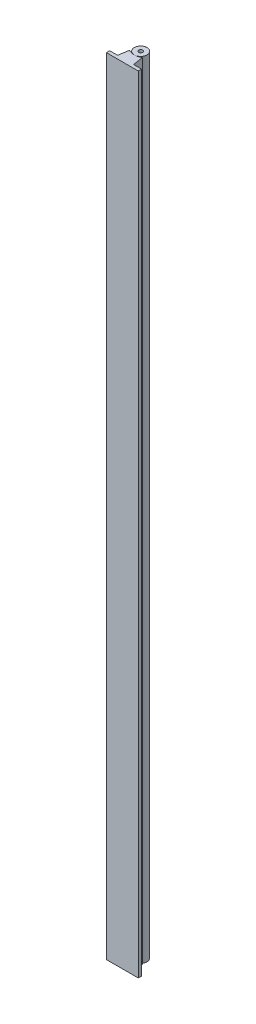
ISO-10303-21;
HEADER;
FILE_DESCRIPTION(('STEP AP214'),'2;1');
FILE_NAME('part.step','',(''),(''),'','','');
FILE_SCHEMA(('AUTOMOTIVE_DESIGN { 1 0 10303 214 1 1 1 1 }'));
ENDSEC;
DATA;
#1=APPLICATION_CONTEXT('core data for automotive mechanical design processes');
#2=APPLICATION_PROTOCOL_DEFINITION('international standard','automotive_design',2000,#1);
#3=PRODUCT_CONTEXT('',#1,'mechanical');
#4=PRODUCT('Part','Part','',(#3));
#5=PRODUCT_RELATED_PRODUCT_CATEGORY('part','',(#4));
#6=PRODUCT_DEFINITION_FORMATION('','',#4);
#7=PRODUCT_DEFINITION_CONTEXT('part definition',#1,'design');
#8=PRODUCT_DEFINITION('design','',#6,#7);
#9=PRODUCT_DEFINITION_SHAPE('','',#8);
#10=(LENGTH_UNIT() NAMED_UNIT(*) SI_UNIT(.MILLI.,.METRE.));
#11=(NAMED_UNIT(*) PLANE_ANGLE_UNIT() SI_UNIT($,.RADIAN.));
#12=(NAMED_UNIT(*) SI_UNIT($,.STERADIAN.) SOLID_ANGLE_UNIT());
#13=UNCERTAINTY_MEASURE_WITH_UNIT(LENGTH_MEASURE(1.E-05),#10,'distance_accuracy_value','');
#14=(GEOMETRIC_REPRESENTATION_CONTEXT(3) GLOBAL_UNCERTAINTY_ASSIGNED_CONTEXT((#13)) GLOBAL_UNIT_ASSIGNED_CONTEXT((#10,
#11,#12)) REPRESENTATION_CONTEXT('',''));
#15=CARTESIAN_POINT('',(0.,0.,0.));
#16=DIRECTION('',(0.,0.,1.));
#17=DIRECTION('',(1.,0.,0.));
#18=AXIS2_PLACEMENT_3D('',#15,#16,#17);
#19=CARTESIAN_POINT('',(-7.27644157816107,985.,-16.2336566640027));
#20=DIRECTION('',(0.,-1.,0.));
#21=DIRECTION('',(0.,0.,-1.));
#22=AXIS2_PLACEMENT_3D('',#19,#20,#21);
#23=CYLINDRICAL_SURFACE('',#22,8.);
#24=CARTESIAN_POINT('',(-7.27644157816107,985.,-16.2336566640027));
#25=DIRECTION('',(0.,1.,0.));
#26=DIRECTION('',(0.,0.,1.));
#27=AXIS2_PLACEMENT_3D('',#24,#25,#26);
#28=CIRCLE('',#27,8.);
#29=CARTESIAN_POINT('',(-7.27644157816107,985.,-8.23365666400274));
#30=VERTEX_POINT('',#29);
#31=EDGE_CURVE('E12',#30,#30,#28,.T.);
#32=ORIENTED_EDGE('',*,*,#31,.F.);
#33=EDGE_LOOP('',(#32));
#34=FACE_BOUND('',#33,.T.);
#35=CARTESIAN_POINT('',(-7.27644157816107,0.,-16.2336566640027));
#36=DIRECTION('',(0.,1.,0.));
#37=DIRECTION('',(0.,0.,1.));
#38=AXIS2_PLACEMENT_3D('',#35,#36,#37);
#39=CIRCLE('',#38,8.);
#40=CARTESIAN_POINT('',(-7.27644157816107,0.,-8.23365666400274));
#41=VERTEX_POINT('',#40);
#42=EDGE_CURVE('E78',#41,#41,#39,.T.);
#43=ORIENTED_EDGE('',*,*,#42,.T.);
#44=EDGE_LOOP('',(#43));
#45=FACE_BOUND('',#44,.T.);
#46=ADVANCED_FACE('F75',(#34,#45),#23,.T.);
#47=CARTESIAN_POINT('',(0.,985.,0.));
#48=DIRECTION('',(0.,1.,0.));
#49=DIRECTION('',(0.,0.,1.));
#50=AXIS2_PLACEMENT_3D('',#47,#48,#49);
#51=PLANE('',#50);
#52=CARTESIAN_POINT('',(-7.27644157816107,985.,-16.2336566640027));
#53=DIRECTION('',(0.,1.,0.));
#54=DIRECTION('',(0.,0.,1.));
#55=AXIS2_PLACEMENT_3D('',#52,#53,#54);
#56=CIRCLE('',#55,2.5);
#57=CARTESIAN_POINT('',(-7.27644157816107,985.,-13.7336566640027));
#58=VERTEX_POINT('',#57);
#59=EDGE_CURVE('E93',#58,#58,#56,.T.);
#60=ORIENTED_EDGE('',*,*,#59,.F.);
#61=EDGE_LOOP('',(#60));
#62=FACE_BOUND('',#61,.T.);
#63=ORIENTED_EDGE('',*,*,#31,.T.);
#64=EDGE_LOOP('',(#63));
#65=FACE_BOUND('',#64,.T.);
#66=ADVANCED_FACE('F108',(#62,#65),#51,.T.);
#67=CARTESIAN_POINT('',(0.,0.,0.));
#68=DIRECTION('',(0.,1.,0.));
#69=DIRECTION('',(0.,0.,1.));
#70=AXIS2_PLACEMENT_3D('',#67,#68,#69);
#71=PLANE('',#70);
#72=CARTESIAN_POINT('',(-7.27644157816107,0.,-16.2336566640027));
#73=DIRECTION('',(0.,-1.,0.));
#74=DIRECTION('',(0.,0.,-1.));
#75=AXIS2_PLACEMENT_3D('',#72,#73,#74);
#76=CIRCLE('',#75,2.5);
#77=CARTESIAN_POINT('',(-7.27644157816107,0.,-18.7336566640027));
#78=VERTEX_POINT('',#77);
#79=EDGE_CURVE('E87',#78,#78,#76,.T.);
#80=ORIENTED_EDGE('',*,*,#79,.F.);
#81=EDGE_LOOP('',(#80));
#82=FACE_BOUND('',#81,.T.);
#83=ORIENTED_EDGE('',*,*,#42,.F.);
#84=EDGE_LOOP('',(#83));
#85=FACE_BOUND('',#84,.T.);
#86=ADVANCED_FACE('F110',(#82,#85),#71,.F.);
#87=CARTESIAN_POINT('',(-7.27644157816107,15.,-16.2336566640027));
#88=DIRECTION('',(0.,-1.,0.));
#89=DIRECTION('',(0.,0.,-1.));
#90=AXIS2_PLACEMENT_3D('',#87,#88,#89);
#91=CYLINDRICAL_SURFACE('',#90,2.5);
#92=CARTESIAN_POINT('',(-7.27644157816107,15.,-16.2336566640027));
#93=DIRECTION('',(0.,-1.,0.));
#94=DIRECTION('',(0.,0.,-1.));
#95=AXIS2_PLACEMENT_3D('',#92,#93,#94);
#96=CIRCLE('',#95,2.5);
#97=CARTESIAN_POINT('',(-7.27644157816107,15.,-18.7336566640027));
#98=VERTEX_POINT('',#97);
#99=EDGE_CURVE('E85',#98,#98,#96,.T.);
#100=ORIENTED_EDGE('',*,*,#99,.F.);
#101=EDGE_LOOP('',(#100));
#102=FACE_BOUND('',#101,.T.);
#103=ORIENTED_EDGE('',*,*,#79,.T.);
#104=EDGE_LOOP('',(#103));
#105=FACE_BOUND('',#104,.T.);
#106=ADVANCED_FACE('F117',(#102,#105),#91,.F.);
#107=CARTESIAN_POINT('',(-7.27644157816107,15.,-16.2336566640027));
#108=DIRECTION('',(0.,-1.,0.));
#109=DIRECTION('',(0.,0.,-1.));
#110=AXIS2_PLACEMENT_3D('',#107,#108,#109);
#111=PLANE('',#110);
#112=ORIENTED_EDGE('',*,*,#99,.T.);
#113=EDGE_LOOP('',(#112));
#114=FACE_BOUND('',#113,.T.);
#115=ADVANCED_FACE('F104',(#114),#111,.T.);
#116=CARTESIAN_POINT('',(-7.27644157816107,970.,-16.2336566640027));
#117=DIRECTION('',(0.,1.,0.));
#118=DIRECTION('',(0.,0.,1.));
#119=AXIS2_PLACEMENT_3D('',#116,#117,#118);
#120=CYLINDRICAL_SURFACE('',#119,2.5);
#121=CARTESIAN_POINT('',(-7.27644157816107,970.,-16.2336566640027));
#122=DIRECTION('',(0.,1.,0.));
#123=DIRECTION('',(0.,0.,1.));
#124=AXIS2_PLACEMENT_3D('',#121,#122,#123);
#125=CIRCLE('',#124,2.5);
#126=CARTESIAN_POINT('',(-7.27644157816107,970.,-13.7336566640027));
#127=VERTEX_POINT('',#126);
#128=EDGE_CURVE('E90',#127,#127,#125,.T.);
#129=ORIENTED_EDGE('',*,*,#128,.F.);
#130=EDGE_LOOP('',(#129));
#131=FACE_BOUND('',#130,.T.);
#132=ORIENTED_EDGE('',*,*,#59,.T.);
#133=EDGE_LOOP('',(#132));
#134=FACE_BOUND('',#133,.T.);
#135=ADVANCED_FACE('F101',(#131,#134),#120,.F.);
#136=CARTESIAN_POINT('',(-7.27644157816107,970.,-16.2336566640027));
#137=DIRECTION('',(0.,1.,0.));
#138=DIRECTION('',(0.,0.,1.));
#139=AXIS2_PLACEMENT_3D('',#136,#137,#138);
#140=PLANE('',#139);
#141=ORIENTED_EDGE('',*,*,#128,.T.);
#142=EDGE_LOOP('',(#141));
#143=FACE_BOUND('',#142,.T.);
#144=ADVANCED_FACE('F99',(#143),#140,.T.);
#145=CLOSED_SHELL('',(#46,#66,#86,#106,#115,#135,#144));
#146=MANIFOLD_SOLID_BREP('B2',#145);
#147=CARTESIAN_POINT('',(-7.27644157816107,985.,-24.2336566640028));
#148=DIRECTION('',(0.,-1.,0.));
#149=DIRECTION('',(0.,0.,-1.));
#150=AXIS2_PLACEMENT_3D('',#147,#148,#149);
#151=CYLINDRICAL_SURFACE('',#150,16.0000000000001);
#152=CARTESIAN_POINT('',(-7.27644157816107,0.,-24.2336566640028));
#153=DIRECTION('',(0.,1.,0.));
#154=DIRECTION('',(0.,0.,1.));
#155=AXIS2_PLACEMENT_3D('',#152,#153,#154);
#156=CIRCLE('',#155,16.0000000000001);
#157=CARTESIAN_POINT('',(-15.2764415781611,0.,-10.3772502034517));
#158=VERTEX_POINT('',#157);
#159=CARTESIAN_POINT('',(0.723558421838933,0.,-10.3772502034517));
#160=VERTEX_POINT('',#159);
#161=EDGE_CURVE('E273',#158,#160,#156,.T.);
#162=ORIENTED_EDGE('',*,*,#161,.F.);
#163=DIRECTION('',(0.,-1.,0.));
#164=VECTOR('',#163,1.);
#165=CARTESIAN_POINT('',(-15.2764415781611,985.,-10.3772502034517));
#166=LINE('',#165,#164);
#167=CARTESIAN_POINT('',(-15.2764415781611,985.,-10.3772502034517));
#168=VERTEX_POINT('',#167);
#169=EDGE_CURVE('E73',#168,#158,#166,.T.);
#170=ORIENTED_EDGE('',*,*,#169,.F.);
#171=CARTESIAN_POINT('',(-7.27644157816107,985.,-24.2336566640028));
#172=DIRECTION('',(0.,1.,0.));
#173=DIRECTION('',(0.,0.,1.));
#174=AXIS2_PLACEMENT_3D('',#171,#172,#173);
#175=CIRCLE('',#174,16.0000000000001);
#176=CARTESIAN_POINT('',(0.723558421838933,985.,-10.3772502034517));
#177=VERTEX_POINT('',#176);
#178=EDGE_CURVE('E299',#168,#177,#175,.T.);
#179=ORIENTED_EDGE('',*,*,#178,.T.);
#180=DIRECTION('',(0.,-1.,0.));
#181=VECTOR('',#180,1.);
#182=CARTESIAN_POINT('',(0.723558421838933,985.,-10.3772502034517));
#183=LINE('',#182,#181);
#184=EDGE_CURVE('E227',#177,#160,#183,.T.);
#185=ORIENTED_EDGE('',*,*,#184,.T.);
#186=EDGE_LOOP('',(#162,#170,#179,#185));
#187=FACE_BOUND('',#186,.T.);
#188=ADVANCED_FACE('F175',(#187),#151,.F.);
#189=CARTESIAN_POINT('',(-16.4828157919015,985.,-2.5358178141387));
#190=DIRECTION('',(-0.988371697650617,0.,-0.152057184253941));
#191=DIRECTION('',(-0.152057184253941,0.,0.988371697650617));
#192=AXIS2_PLACEMENT_3D('',#189,#190,#191);
#193=PLANE('',#192);
#194=DIRECTION('',(0.152057184253941,0.,-0.988371697650617));
#195=VECTOR('',#194,1.);
#196=CARTESIAN_POINT('',(-16.4828157919015,0.,-2.5358178141387));
#197=LINE('',#196,#195);
#198=CARTESIAN_POINT('',(-17.2764415781611,0.,2.6227497965483));
#199=VERTEX_POINT('',#198);
#200=EDGE_CURVE('E277',#199,#158,#197,.T.);
#201=ORIENTED_EDGE('',*,*,#200,.F.);
#202=DIRECTION('',(0.,-1.,0.));
#203=VECTOR('',#202,1.);
#204=CARTESIAN_POINT('',(-17.2764415781611,985.,2.6227497965483));
#205=LINE('',#204,#203);
#206=CARTESIAN_POINT('',(-17.2764415781611,985.,2.6227497965483));
#207=VERTEX_POINT('',#206);
#208=EDGE_CURVE('E184',#207,#199,#205,.T.);
#209=ORIENTED_EDGE('',*,*,#208,.F.);
#210=DIRECTION('',(0.152057184253941,0.,-0.988371697650617));
#211=VECTOR('',#210,1.);
#212=CARTESIAN_POINT('',(-16.4828157919015,985.,-2.5358178141387));
#213=LINE('',#212,#211);
#214=EDGE_CURVE('E331',#207,#168,#213,.T.);
#215=ORIENTED_EDGE('',*,*,#214,.T.);
#216=ORIENTED_EDGE('',*,*,#169,.T.);
#217=EDGE_LOOP('',(#201,#209,#215,#216));
#218=FACE_BOUND('',#217,.T.);
#219=ADVANCED_FACE('F322',(#218),#193,.T.);
#220=CARTESIAN_POINT('',(0.,985.,2.6227497965483));
#221=DIRECTION('',(0.,0.,-1.));
#222=DIRECTION('',(-1.,0.,0.));
#223=AXIS2_PLACEMENT_3D('',#220,#221,#222);
#224=PLANE('',#223);
#225=DIRECTION('',(1.,0.,0.));
#226=VECTOR('',#225,1.);
#227=CARTESIAN_POINT('',(0.,0.,2.6227497965483));
#228=LINE('',#227,#226);
#229=CARTESIAN_POINT('',(-27.2764415781611,0.,2.6227497965483));
#230=VERTEX_POINT('',#229);
#231=EDGE_CURVE('E281',#230,#199,#228,.T.);
#232=ORIENTED_EDGE('',*,*,#231,.F.);
#233=DIRECTION('',(0.,-1.,0.));
#234=VECTOR('',#233,1.);
#235=CARTESIAN_POINT('',(-27.2764415781611,985.,2.6227497965483));
#236=LINE('',#235,#234);
#237=CARTESIAN_POINT('',(-27.2764415781611,985.,2.6227497965483));
#238=VERTEX_POINT('',#237);
#239=EDGE_CURVE('E309',#238,#230,#236,.T.);
#240=ORIENTED_EDGE('',*,*,#239,.F.);
#241=DIRECTION('',(1.,0.,0.));
#242=VECTOR('',#241,1.);
#243=CARTESIAN_POINT('',(0.,985.,2.6227497965483));
#244=LINE('',#243,#242);
#245=EDGE_CURVE('E318',#238,#207,#244,.T.);
#246=ORIENTED_EDGE('',*,*,#245,.T.);
#247=ORIENTED_EDGE('',*,*,#208,.T.);
#248=EDGE_LOOP('',(#232,#240,#246,#247));
#249=FACE_BOUND('',#248,.T.);
#250=ADVANCED_FACE('F316',(#249),#224,.T.);
#251=CARTESIAN_POINT('',(-27.2764415781611,985.,0.));
#252=DIRECTION('',(-1.,0.,0.));
#253=DIRECTION('',(0.,0.,1.));
#254=AXIS2_PLACEMENT_3D('',#251,#252,#253);
#255=PLANE('',#254);
#256=DIRECTION('',(0.,0.,-1.));
#257=VECTOR('',#256,1.);
#258=CARTESIAN_POINT('',(-27.2764415781611,0.,0.));
#259=LINE('',#258,#257);
#260=CARTESIAN_POINT('',(-27.2764415781611,0.,6.7227497965483));
#261=VERTEX_POINT('',#260);
#262=EDGE_CURVE('E285',#261,#230,#259,.T.);
#263=ORIENTED_EDGE('',*,*,#262,.F.);
#264=DIRECTION('',(0.,-1.,0.));
#265=VECTOR('',#264,1.);
#266=CARTESIAN_POINT('',(-27.2764415781611,985.,6.7227497965483));
#267=LINE('',#266,#265);
#268=CARTESIAN_POINT('',(-27.2764415781611,985.,6.7227497965483));
#269=VERTEX_POINT('',#268);
#270=EDGE_CURVE('E306',#269,#261,#267,.T.);
#271=ORIENTED_EDGE('',*,*,#270,.F.);
#272=DIRECTION('',(0.,0.,-1.));
#273=VECTOR('',#272,1.);
#274=CARTESIAN_POINT('',(-27.2764415781611,985.,0.));
#275=LINE('',#274,#273);
#276=EDGE_CURVE('E330',#269,#238,#275,.T.);
#277=ORIENTED_EDGE('',*,*,#276,.T.);
#278=ORIENTED_EDGE('',*,*,#239,.T.);
#279=EDGE_LOOP('',(#263,#271,#277,#278));
#280=FACE_BOUND('',#279,.T.);
#281=ADVANCED_FACE('F328',(#280),#255,.T.);
#282=CARTESIAN_POINT('',(0.,985.,6.7227497965483));
#283=DIRECTION('',(0.,0.,-1.));
#284=DIRECTION('',(-1.,0.,0.));
#285=AXIS2_PLACEMENT_3D('',#282,#283,#284);
#286=PLANE('',#285);
#287=DIRECTION('',(1.,0.,0.));
#288=VECTOR('',#287,1.);
#289=CARTESIAN_POINT('',(0.,0.,6.7227497965483));
#290=LINE('',#289,#288);
#291=CARTESIAN_POINT('',(12.7235584218389,0.,6.7227497965483));
#292=VERTEX_POINT('',#291);
#293=EDGE_CURVE('E289',#261,#292,#290,.T.);
#294=ORIENTED_EDGE('',*,*,#293,.T.);
#295=DIRECTION('',(0.,-1.,0.));
#296=VECTOR('',#295,1.);
#297=CARTESIAN_POINT('',(12.7235584218389,985.,6.7227497965483));
#298=LINE('',#297,#296);
#299=CARTESIAN_POINT('',(12.7235584218389,985.,6.7227497965483));
#300=VERTEX_POINT('',#299);
#301=EDGE_CURVE('E263',#300,#292,#298,.T.);
#302=ORIENTED_EDGE('',*,*,#301,.F.);
#303=DIRECTION('',(1.,0.,0.));
#304=VECTOR('',#303,1.);
#305=CARTESIAN_POINT('',(0.,985.,6.7227497965483));
#306=LINE('',#305,#304);
#307=EDGE_CURVE('E252',#269,#300,#306,.T.);
#308=ORIENTED_EDGE('',*,*,#307,.F.);
#309=ORIENTED_EDGE('',*,*,#270,.T.);
#310=EDGE_LOOP('',(#294,#302,#308,#309));
#311=FACE_BOUND('',#310,.T.);
#312=ADVANCED_FACE('F352',(#311),#286,.F.);
#313=CARTESIAN_POINT('',(12.7235584218389,985.,0.));
#314=DIRECTION('',(-1.,0.,0.));
#315=DIRECTION('',(0.,0.,1.));
#316=AXIS2_PLACEMENT_3D('',#313,#314,#315);
#317=PLANE('',#316);
#318=DIRECTION('',(0.,0.,-1.));
#319=VECTOR('',#318,1.);
#320=CARTESIAN_POINT('',(12.7235584218389,0.,0.));
#321=LINE('',#320,#319);
#322=CARTESIAN_POINT('',(12.7235584218389,0.,2.6227497965483));
#323=VERTEX_POINT('',#322);
#324=EDGE_CURVE('E261',#292,#323,#321,.T.);
#325=ORIENTED_EDGE('',*,*,#324,.T.);
#326=DIRECTION('',(0.,-1.,0.));
#327=VECTOR('',#326,1.);
#328=CARTESIAN_POINT('',(12.7235584218389,985.,2.6227497965483));
#329=LINE('',#328,#327);
#330=CARTESIAN_POINT('',(12.7235584218389,985.,2.6227497965483));
#331=VERTEX_POINT('',#330);
#332=EDGE_CURVE('E258',#331,#323,#329,.T.);
#333=ORIENTED_EDGE('',*,*,#332,.F.);
#334=DIRECTION('',(0.,0.,-1.));
#335=VECTOR('',#334,1.);
#336=CARTESIAN_POINT('',(12.7235584218389,985.,0.));
#337=LINE('',#336,#335);
#338=EDGE_CURVE('E245',#300,#331,#337,.T.);
#339=ORIENTED_EDGE('',*,*,#338,.F.);
#340=ORIENTED_EDGE('',*,*,#301,.T.);
#341=EDGE_LOOP('',(#325,#333,#339,#340));
#342=FACE_BOUND('',#341,.T.);
#343=ADVANCED_FACE('F259',(#342),#317,.F.);
#344=CARTESIAN_POINT('',(0.,985.,2.6227497965483));
#345=DIRECTION('',(0.,0.,1.));
#346=DIRECTION('',(1.,0.,0.));
#347=AXIS2_PLACEMENT_3D('',#344,#345,#346);
#348=PLANE('',#347);
#349=DIRECTION('',(-1.,0.,0.));
#350=VECTOR('',#349,1.);
#351=CARTESIAN_POINT('',(0.,0.,2.6227497965483));
#352=LINE('',#351,#350);
#353=CARTESIAN_POINT('',(2.72355842183894,0.,2.6227497965483));
#354=VERTEX_POINT('',#353);
#355=EDGE_CURVE('E220',#323,#354,#352,.T.);
#356=ORIENTED_EDGE('',*,*,#355,.T.);
#357=DIRECTION('',(0.,-1.,0.));
#358=VECTOR('',#357,1.);
#359=CARTESIAN_POINT('',(2.72355842183894,985.,2.6227497965483));
#360=LINE('',#359,#358);
#361=CARTESIAN_POINT('',(2.72355842183894,985.,2.6227497965483));
#362=VERTEX_POINT('',#361);
#363=EDGE_CURVE('E264',#362,#354,#360,.T.);
#364=ORIENTED_EDGE('',*,*,#363,.F.);
#365=DIRECTION('',(-1.,0.,0.));
#366=VECTOR('',#365,1.);
#367=CARTESIAN_POINT('',(0.,985.,2.6227497965483));
#368=LINE('',#367,#366);
#369=EDGE_CURVE('E249',#331,#362,#368,.T.);
#370=ORIENTED_EDGE('',*,*,#369,.F.);
#371=ORIENTED_EDGE('',*,*,#332,.T.);
#372=EDGE_LOOP('',(#356,#364,#370,#371));
#373=FACE_BOUND('',#372,.T.);
#374=ADVANCED_FACE('F266',(#373),#348,.F.);
#375=CARTESIAN_POINT('',(2.26641548312442,985.,-0.348679305096064));
#376=DIRECTION('',(-0.988371697650617,0.,0.152057184253941));
#377=DIRECTION('',(0.152057184253941,0.,0.988371697650617));
#378=AXIS2_PLACEMENT_3D('',#375,#376,#377);
#379=PLANE('',#378);
#380=DIRECTION('',(-0.152057184253941,0.,-0.988371697650617));
#381=VECTOR('',#380,1.);
#382=CARTESIAN_POINT('',(2.26641548312442,0.,-0.348679305096064));
#383=LINE('',#382,#381);
#384=EDGE_CURVE('E296',#354,#160,#383,.T.);
#385=ORIENTED_EDGE('',*,*,#384,.T.);
#386=ORIENTED_EDGE('',*,*,#184,.F.);
#387=DIRECTION('',(-0.152057184253941,0.,-0.988371697650617));
#388=VECTOR('',#387,1.);
#389=CARTESIAN_POINT('',(2.26641548312442,985.,-0.348679305096064));
#390=LINE('',#389,#388);
#391=EDGE_CURVE('E192',#362,#177,#390,.T.);
#392=ORIENTED_EDGE('',*,*,#391,.F.);
#393=ORIENTED_EDGE('',*,*,#363,.T.);
#394=EDGE_LOOP('',(#385,#386,#392,#393));
#395=FACE_BOUND('',#394,.T.);
#396=ADVANCED_FACE('F360',(#395),#379,.F.);
#397=CARTESIAN_POINT('',(0.,985.,0.));
#398=DIRECTION('',(0.,1.,0.));
#399=DIRECTION('',(0.,0.,1.));
#400=AXIS2_PLACEMENT_3D('',#397,#398,#399);
#401=PLANE('',#400);
#402=ORIENTED_EDGE('',*,*,#178,.F.);
#403=ORIENTED_EDGE('',*,*,#214,.F.);
#404=ORIENTED_EDGE('',*,*,#245,.F.);
#405=ORIENTED_EDGE('',*,*,#276,.F.);
#406=ORIENTED_EDGE('',*,*,#307,.T.);
#407=ORIENTED_EDGE('',*,*,#338,.T.);
#408=ORIENTED_EDGE('',*,*,#369,.T.);
#409=ORIENTED_EDGE('',*,*,#391,.T.);
#410=EDGE_LOOP('',(#402,#403,#404,#405,#406,#407,#408,#409));
#411=FACE_BOUND('',#410,.T.);
#412=ADVANCED_FACE('F247',(#411),#401,.T.);
#413=CARTESIAN_POINT('',(0.,0.,0.));
#414=DIRECTION('',(0.,1.,0.));
#415=DIRECTION('',(0.,0.,1.));
#416=AXIS2_PLACEMENT_3D('',#413,#414,#415);
#417=PLANE('',#416);
#418=ORIENTED_EDGE('',*,*,#161,.T.);
#419=ORIENTED_EDGE('',*,*,#384,.F.);
#420=ORIENTED_EDGE('',*,*,#355,.F.);
#421=ORIENTED_EDGE('',*,*,#324,.F.);
#422=ORIENTED_EDGE('',*,*,#293,.F.);
#423=ORIENTED_EDGE('',*,*,#262,.T.);
#424=ORIENTED_EDGE('',*,*,#231,.T.);
#425=ORIENTED_EDGE('',*,*,#200,.T.);
#426=EDGE_LOOP('',(#418,#419,#420,#421,#422,#423,#424,#425));
#427=FACE_BOUND('',#426,.T.);
#428=ADVANCED_FACE('F324',(#427),#417,.F.);
#429=CLOSED_SHELL('',(#188,#219,#250,#281,#312,#343,#374,#396,#412,#428));
#430=MANIFOLD_SOLID_BREP('B7',#429);
#431=ADVANCED_BREP_SHAPE_REPRESENTATION('',(#18,#146,#430),#14);
#432=SHAPE_DEFINITION_REPRESENTATION(#9,#431);
ENDSEC;
END-ISO-10303-21;
